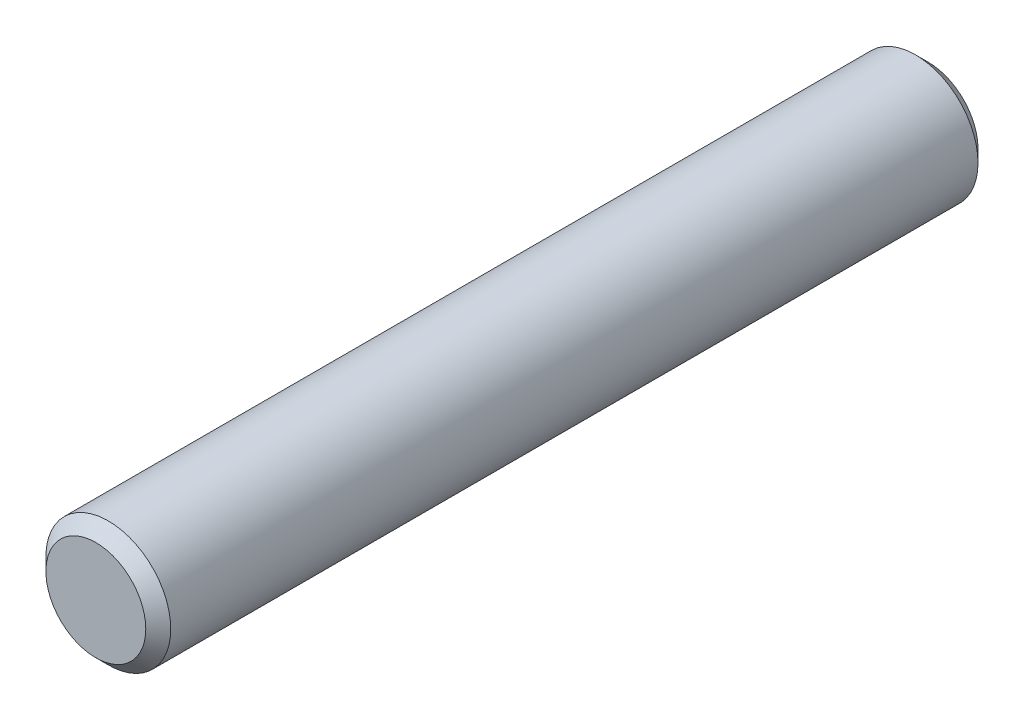
ISO-10303-21;
HEADER;
FILE_DESCRIPTION(('STEP AP214'),'2;1');
FILE_NAME('part.step','',(''),(''),'','','');
FILE_SCHEMA(('AUTOMOTIVE_DESIGN { 1 0 10303 214 1 1 1 1 }'));
ENDSEC;
DATA;
#1=APPLICATION_CONTEXT('core data for automotive mechanical design processes');
#2=APPLICATION_PROTOCOL_DEFINITION('international standard','automotive_design',2000,#1);
#3=PRODUCT_CONTEXT('',#1,'mechanical');
#4=PRODUCT('Part','Part','',(#3));
#5=PRODUCT_RELATED_PRODUCT_CATEGORY('part','',(#4));
#6=PRODUCT_DEFINITION_FORMATION('','',#4);
#7=PRODUCT_DEFINITION_CONTEXT('part definition',#1,'design');
#8=PRODUCT_DEFINITION('design','',#6,#7);
#9=PRODUCT_DEFINITION_SHAPE('','',#8);
#10=(LENGTH_UNIT() NAMED_UNIT(*) SI_UNIT(.MILLI.,.METRE.));
#11=(NAMED_UNIT(*) PLANE_ANGLE_UNIT() SI_UNIT($,.RADIAN.));
#12=(NAMED_UNIT(*) SI_UNIT($,.STERADIAN.) SOLID_ANGLE_UNIT());
#13=UNCERTAINTY_MEASURE_WITH_UNIT(LENGTH_MEASURE(1.E-05),#10,'distance_accuracy_value','');
#14=(GEOMETRIC_REPRESENTATION_CONTEXT(3) GLOBAL_UNCERTAINTY_ASSIGNED_CONTEXT((#13)) GLOBAL_UNIT_ASSIGNED_CONTEXT((#10,
#11,#12)) REPRESENTATION_CONTEXT('',''));
#15=CARTESIAN_POINT('',(0.,0.,0.));
#16=DIRECTION('',(0.,0.,1.));
#17=DIRECTION('',(1.,0.,0.));
#18=AXIS2_PLACEMENT_3D('',#15,#16,#17);
#19=CARTESIAN_POINT('',(0.,0.,10.));
#20=DIRECTION('',(0.,0.,-1.));
#21=DIRECTION('',(-1.,0.,0.));
#22=AXIS2_PLACEMENT_3D('',#19,#20,#21);
#23=CYLINDRICAL_SURFACE('',#22,1.5);
#24=CARTESIAN_POINT('',(0.,0.,-9.7));
#25=DIRECTION('',(0.,0.,1.));
#26=DIRECTION('',(1.,0.,0.));
#27=AXIS2_PLACEMENT_3D('',#24,#25,#26);
#28=CIRCLE('',#27,1.5);
#29=CARTESIAN_POINT('',(1.5,0.,-9.7));
#30=VERTEX_POINT('',#29);
#31=EDGE_CURVE('E31',#30,#30,#28,.T.);
#32=ORIENTED_EDGE('',*,*,#31,.T.);
#33=EDGE_LOOP('',(#32));
#34=FACE_BOUND('',#33,.T.);
#35=CARTESIAN_POINT('',(0.,0.,9.7));
#36=DIRECTION('',(0.,0.,1.));
#37=DIRECTION('',(1.,0.,0.));
#38=AXIS2_PLACEMENT_3D('',#35,#36,#37);
#39=CIRCLE('',#38,1.5);
#40=CARTESIAN_POINT('',(1.5,0.,9.7));
#41=VERTEX_POINT('',#40);
#42=EDGE_CURVE('E37',#41,#41,#39,.F.);
#43=ORIENTED_EDGE('',*,*,#42,.T.);
#44=EDGE_LOOP('',(#43));
#45=FACE_BOUND('',#44,.T.);
#46=ADVANCED_FACE('F15',(#34,#45),#23,.T.);
#47=CARTESIAN_POINT('',(0.,0.,10.));
#48=DIRECTION('',(0.,0.,1.));
#49=DIRECTION('',(1.,0.,0.));
#50=AXIS2_PLACEMENT_3D('',#47,#48,#49);
#51=PLANE('',#50);
#52=CARTESIAN_POINT('',(0.,0.,10.));
#53=DIRECTION('',(0.,0.,1.));
#54=DIRECTION('',(1.,0.,0.));
#55=AXIS2_PLACEMENT_3D('',#52,#53,#54);
#56=CIRCLE('',#55,1.2);
#57=CARTESIAN_POINT('',(1.2,0.,10.));
#58=VERTEX_POINT('',#57);
#59=EDGE_CURVE('E10',#58,#58,#56,.T.);
#60=ORIENTED_EDGE('',*,*,#59,.T.);
#61=EDGE_LOOP('',(#60));
#62=FACE_BOUND('',#61,.T.);
#63=ADVANCED_FACE('F56',(#62),#51,.T.);
#64=CARTESIAN_POINT('',(0.,0.,-10.));
#65=DIRECTION('',(0.,0.,1.));
#66=DIRECTION('',(1.,0.,0.));
#67=AXIS2_PLACEMENT_3D('',#64,#65,#66);
#68=PLANE('',#67);
#69=CARTESIAN_POINT('',(0.,0.,-10.));
#70=DIRECTION('',(0.,0.,1.));
#71=DIRECTION('',(1.,0.,0.));
#72=AXIS2_PLACEMENT_3D('',#69,#70,#71);
#73=CIRCLE('',#72,1.2);
#74=CARTESIAN_POINT('',(1.2,0.,-10.));
#75=VERTEX_POINT('',#74);
#76=EDGE_CURVE('E24',#75,#75,#73,.F.);
#77=ORIENTED_EDGE('',*,*,#76,.T.);
#78=EDGE_LOOP('',(#77));
#79=FACE_BOUND('',#78,.T.);
#80=ADVANCED_FACE('F53',(#79),#68,.F.);
#81=CARTESIAN_POINT('',(0.,0.,-9.7));
#82=DIRECTION('',(0.,0.,1.));
#83=DIRECTION('',(1.,0.,0.));
#84=AXIS2_PLACEMENT_3D('',#81,#82,#83);
#85=CONICAL_SURFACE('',#84,1.5,0.785398163397452);
#86=ORIENTED_EDGE('',*,*,#76,.F.);
#87=EDGE_LOOP('',(#86));
#88=FACE_BOUND('',#87,.T.);
#89=ORIENTED_EDGE('',*,*,#31,.F.);
#90=EDGE_LOOP('',(#89));
#91=FACE_BOUND('',#90,.T.);
#92=ADVANCED_FACE('F48',(#88,#91),#85,.T.);
#93=CARTESIAN_POINT('',(0.,0.,10.));
#94=DIRECTION('',(0.,0.,-1.));
#95=DIRECTION('',(-1.,0.,0.));
#96=AXIS2_PLACEMENT_3D('',#93,#94,#95);
#97=CONICAL_SURFACE('',#96,1.2,0.785398163397446);
#98=ORIENTED_EDGE('',*,*,#42,.F.);
#99=EDGE_LOOP('',(#98));
#100=FACE_BOUND('',#99,.T.);
#101=ORIENTED_EDGE('',*,*,#59,.F.);
#102=EDGE_LOOP('',(#101));
#103=FACE_BOUND('',#102,.T.);
#104=ADVANCED_FACE('F18',(#100,#103),#97,.T.);
#105=CLOSED_SHELL('',(#46,#63,#80,#92,#104));
#106=MANIFOLD_SOLID_BREP('B1',#105);
#107=ADVANCED_BREP_SHAPE_REPRESENTATION('',(#18,#106),#14);
#108=SHAPE_DEFINITION_REPRESENTATION(#9,#107);
ENDSEC;
END-ISO-10303-21;
